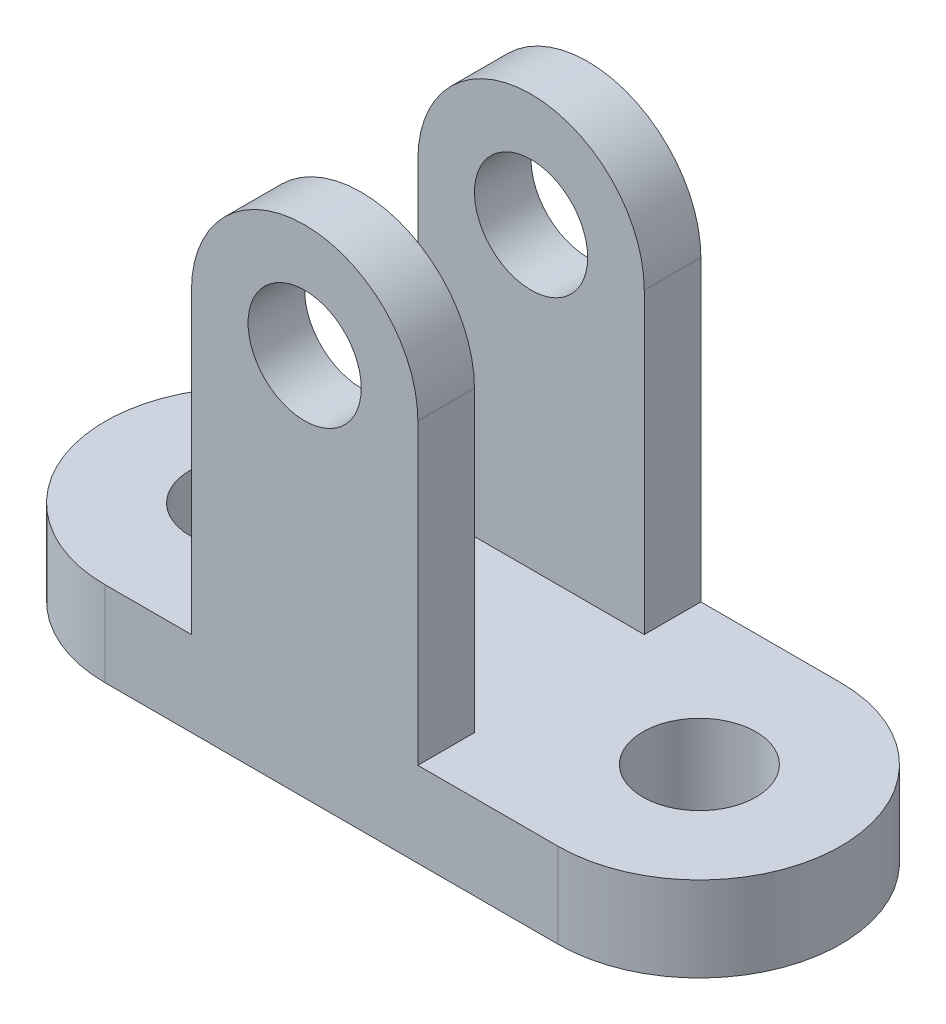
ISO-10303-21;
HEADER;
FILE_DESCRIPTION(('STEP AP214'),'2;1');
FILE_NAME('part.step','',(''),(''),'','','');
FILE_SCHEMA(('AUTOMOTIVE_DESIGN { 1 0 10303 214 1 1 1 1 }'));
ENDSEC;
DATA;
#1=APPLICATION_CONTEXT('core data for automotive mechanical design processes');
#2=APPLICATION_PROTOCOL_DEFINITION('international standard','automotive_design',2000,#1);
#3=PRODUCT_CONTEXT('',#1,'mechanical');
#4=PRODUCT('Part','Part','',(#3));
#5=PRODUCT_RELATED_PRODUCT_CATEGORY('part','',(#4));
#6=PRODUCT_DEFINITION_FORMATION('','',#4);
#7=PRODUCT_DEFINITION_CONTEXT('part definition',#1,'design');
#8=PRODUCT_DEFINITION('design','',#6,#7);
#9=PRODUCT_DEFINITION_SHAPE('','',#8);
#10=(LENGTH_UNIT() NAMED_UNIT(*) SI_UNIT(.MILLI.,.METRE.));
#11=(NAMED_UNIT(*) PLANE_ANGLE_UNIT() SI_UNIT($,.RADIAN.));
#12=(NAMED_UNIT(*) SI_UNIT($,.STERADIAN.) SOLID_ANGLE_UNIT());
#13=UNCERTAINTY_MEASURE_WITH_UNIT(LENGTH_MEASURE(1.E-05),#10,'distance_accuracy_value','');
#14=(GEOMETRIC_REPRESENTATION_CONTEXT(3) GLOBAL_UNCERTAINTY_ASSIGNED_CONTEXT((#13)) GLOBAL_UNIT_ASSIGNED_CONTEXT((#10,
#11,#12)) REPRESENTATION_CONTEXT('',''));
#15=CARTESIAN_POINT('',(0.,0.,0.));
#16=DIRECTION('',(0.,0.,1.));
#17=DIRECTION('',(1.,0.,0.));
#18=AXIS2_PLACEMENT_3D('',#15,#16,#17);
#19=CARTESIAN_POINT('',(0.,67.6994937518876,-25.));
#20=DIRECTION('',(0.,0.,1.));
#21=DIRECTION('',(1.,0.,0.));
#22=AXIS2_PLACEMENT_3D('',#19,#20,#21);
#23=CYLINDRICAL_SURFACE('',#22,20.);
#24=CARTESIAN_POINT('',(0.,67.6994937518876,15.));
#25=DIRECTION('',(0.,0.,1.));
#26=DIRECTION('',(0.,-1.,0.));
#27=AXIS2_PLACEMENT_3D('',#24,#25,#26);
#28=CIRCLE('',#27,20.);
#29=CARTESIAN_POINT('',(-20.,67.6994937518876,15.));
#30=VERTEX_POINT('',#29);
#31=CARTESIAN_POINT('',(20.,67.6994937518876,15.));
#32=VERTEX_POINT('',#31);
#33=EDGE_CURVE('E248',#30,#32,#28,.F.);
#34=ORIENTED_EDGE('',*,*,#33,.F.);
#35=DIRECTION('',(0.,0.,1.));
#36=VECTOR('',#35,1.);
#37=CARTESIAN_POINT('',(-20.,67.6994937518876,-25.));
#38=LINE('',#37,#36);
#39=CARTESIAN_POINT('',(-20.,67.6994937518876,25.));
#40=VERTEX_POINT('',#39);
#41=EDGE_CURVE('E179',#30,#40,#38,.T.);
#42=ORIENTED_EDGE('',*,*,#41,.T.);
#43=CARTESIAN_POINT('',(0.,67.6994937518876,25.));
#44=DIRECTION('',(0.,0.,1.));
#45=DIRECTION('',(1.,0.,0.));
#46=AXIS2_PLACEMENT_3D('',#43,#44,#45);
#47=CIRCLE('',#46,20.);
#48=CARTESIAN_POINT('',(20.,67.6994937518876,25.));
#49=VERTEX_POINT('',#48);
#50=EDGE_CURVE('E259',#49,#40,#47,.T.);
#51=ORIENTED_EDGE('',*,*,#50,.F.);
#52=DIRECTION('',(0.,0.,1.));
#53=VECTOR('',#52,1.);
#54=CARTESIAN_POINT('',(20.,67.6994937518876,-25.));
#55=LINE('',#54,#53);
#56=EDGE_CURVE('E164',#32,#49,#55,.T.);
#57=ORIENTED_EDGE('',*,*,#56,.F.);
#58=EDGE_LOOP('',(#34,#42,#51,#57));
#59=FACE_BOUND('',#58,.T.);
#60=ADVANCED_FACE('F45',(#59),#23,.T.);
#61=CARTESIAN_POINT('',(20.,67.6994937518876,-25.));
#62=DIRECTION('',(1.,0.,0.));
#63=DIRECTION('',(0.,0.,-1.));
#64=AXIS2_PLACEMENT_3D('',#61,#62,#63);
#65=PLANE('',#64);
#66=DIRECTION('',(0.,-1.,0.));
#67=VECTOR('',#66,1.);
#68=CARTESIAN_POINT('',(20.,67.6994937518876,15.));
#69=LINE('',#68,#67);
#70=CARTESIAN_POINT('',(20.,15.,15.));
#71=VERTEX_POINT('',#70);
#72=EDGE_CURVE('E251',#32,#71,#69,.T.);
#73=ORIENTED_EDGE('',*,*,#72,.F.);
#74=ORIENTED_EDGE('',*,*,#56,.T.);
#75=DIRECTION('',(0.,1.,0.));
#76=VECTOR('',#75,1.);
#77=CARTESIAN_POINT('',(20.,67.6994937518876,25.));
#78=LINE('',#77,#76);
#79=CARTESIAN_POINT('',(20.,15.,25.));
#80=VERTEX_POINT('',#79);
#81=EDGE_CURVE('E268',#80,#49,#78,.T.);
#82=ORIENTED_EDGE('',*,*,#81,.F.);
#83=DIRECTION('',(0.,0.,1.));
#84=VECTOR('',#83,1.);
#85=CARTESIAN_POINT('',(20.,15.,-25.));
#86=LINE('',#85,#84);
#87=EDGE_CURVE('E70',#71,#80,#86,.T.);
#88=ORIENTED_EDGE('',*,*,#87,.F.);
#89=EDGE_LOOP('',(#73,#74,#82,#88));
#90=FACE_BOUND('',#89,.T.);
#91=ADVANCED_FACE('F290',(#90),#65,.T.);
#92=CARTESIAN_POINT('',(-20.,67.6994937518876,-25.));
#93=DIRECTION('',(-1.,0.,0.));
#94=DIRECTION('',(0.,0.,1.));
#95=AXIS2_PLACEMENT_3D('',#92,#93,#94);
#96=PLANE('',#95);
#97=DIRECTION('',(0.,1.,0.));
#98=VECTOR('',#97,1.);
#99=CARTESIAN_POINT('',(-20.,67.6994937518876,15.));
#100=LINE('',#99,#98);
#101=CARTESIAN_POINT('',(-20.,15.,15.));
#102=VERTEX_POINT('',#101);
#103=EDGE_CURVE('E244',#102,#30,#100,.T.);
#104=ORIENTED_EDGE('',*,*,#103,.F.);
#105=DIRECTION('',(0.,0.,1.));
#106=VECTOR('',#105,1.);
#107=CARTESIAN_POINT('',(-20.,15.,-25.));
#108=LINE('',#107,#106);
#109=CARTESIAN_POINT('',(-20.,15.,25.));
#110=VERTEX_POINT('',#109);
#111=EDGE_CURVE('E174',#102,#110,#108,.T.);
#112=ORIENTED_EDGE('',*,*,#111,.T.);
#113=DIRECTION('',(0.,-1.,0.));
#114=VECTOR('',#113,1.);
#115=CARTESIAN_POINT('',(-20.,67.6994937518876,25.));
#116=LINE('',#115,#114);
#117=EDGE_CURVE('E277',#40,#110,#116,.T.);
#118=ORIENTED_EDGE('',*,*,#117,.F.);
#119=ORIENTED_EDGE('',*,*,#41,.F.);
#120=EDGE_LOOP('',(#104,#112,#118,#119));
#121=FACE_BOUND('',#120,.T.);
#122=ADVANCED_FACE('F298',(#121),#96,.T.);
#123=CARTESIAN_POINT('',(0.,67.6994937518876,-25.));
#124=DIRECTION('',(0.,0.,1.));
#125=DIRECTION('',(1.,0.,0.));
#126=AXIS2_PLACEMENT_3D('',#123,#124,#125);
#127=CYLINDRICAL_SURFACE('',#126,10.);
#128=CARTESIAN_POINT('',(0.,67.6994937518876,15.));
#129=DIRECTION('',(0.,0.,1.));
#130=DIRECTION('',(0.,-1.,0.));
#131=AXIS2_PLACEMENT_3D('',#128,#129,#130);
#132=CIRCLE('',#131,10.);
#133=CARTESIAN_POINT('',(0.,57.6994937518876,15.));
#134=VERTEX_POINT('',#133);
#135=EDGE_CURVE('E49',#134,#134,#132,.F.);
#136=ORIENTED_EDGE('',*,*,#135,.T.);
#137=EDGE_LOOP('',(#136));
#138=FACE_BOUND('',#137,.T.);
#139=CARTESIAN_POINT('',(0.,67.6994937518876,25.));
#140=DIRECTION('',(0.,0.,1.));
#141=DIRECTION('',(1.,0.,0.));
#142=AXIS2_PLACEMENT_3D('',#139,#140,#141);
#143=CIRCLE('',#142,10.);
#144=CARTESIAN_POINT('',(10.,67.6994937518876,25.));
#145=VERTEX_POINT('',#144);
#146=EDGE_CURVE('E254',#145,#145,#143,.T.);
#147=ORIENTED_EDGE('',*,*,#146,.T.);
#148=EDGE_LOOP('',(#147));
#149=FACE_BOUND('',#148,.T.);
#150=ADVANCED_FACE('F336',(#138,#149),#127,.F.);
#151=CARTESIAN_POINT('',(-35.2583588511625,15.,0.));
#152=DIRECTION('',(0.,1.,0.));
#153=DIRECTION('',(0.,0.,1.));
#154=AXIS2_PLACEMENT_3D('',#151,#152,#153);
#155=PLANE('',#154);
#156=CARTESIAN_POINT('',(20.,15.,-25.));
#157=VERTEX_POINT('',#156);
#158=CARTESIAN_POINT('',(20.,15.,-15.));
#159=VERTEX_POINT('',#158);
#160=EDGE_CURVE('E152',#157,#159,#86,.T.);
#161=ORIENTED_EDGE('',*,*,#160,.T.);
#162=DIRECTION('',(1.,0.,0.));
#163=VECTOR('',#162,1.);
#164=CARTESIAN_POINT('',(-25.,15.,-15.));
#165=LINE('',#164,#163);
#166=CARTESIAN_POINT('',(-20.,15.,-15.));
#167=VERTEX_POINT('',#166);
#168=EDGE_CURVE('E63',#167,#159,#165,.T.);
#169=ORIENTED_EDGE('',*,*,#168,.F.);
#170=CARTESIAN_POINT('',(-20.,15.,-25.));
#171=VERTEX_POINT('',#170);
#172=EDGE_CURVE('E169',#171,#167,#108,.T.);
#173=ORIENTED_EDGE('',*,*,#172,.F.);
#174=DIRECTION('',(-1.,0.,0.));
#175=VECTOR('',#174,1.);
#176=CARTESIAN_POINT('',(-35.2583588511625,15.,-25.));
#177=LINE('',#176,#175);
#178=CARTESIAN_POINT('',(-35.2583588511625,15.,-25.));
#179=VERTEX_POINT('',#178);
#180=EDGE_CURVE('E210',#171,#179,#177,.T.);
#181=ORIENTED_EDGE('',*,*,#180,.T.);
#182=CARTESIAN_POINT('',(-35.2583588511625,15.,0.));
#183=DIRECTION('',(0.,1.,0.));
#184=DIRECTION('',(0.,0.,1.));
#185=AXIS2_PLACEMENT_3D('',#182,#183,#184);
#186=CIRCLE('',#185,25.);
#187=CARTESIAN_POINT('',(-35.2583588511625,15.,25.));
#188=VERTEX_POINT('',#187);
#189=EDGE_CURVE('E197',#179,#188,#186,.T.);
#190=ORIENTED_EDGE('',*,*,#189,.T.);
#191=DIRECTION('',(1.,0.,0.));
#192=VECTOR('',#191,1.);
#193=CARTESIAN_POINT('',(-35.2583588511625,15.,25.));
#194=LINE('',#193,#192);
#195=EDGE_CURVE('E203',#188,#110,#194,.T.);
#196=ORIENTED_EDGE('',*,*,#195,.T.);
#197=ORIENTED_EDGE('',*,*,#111,.F.);
#198=DIRECTION('',(1.,0.,0.));
#199=VECTOR('',#198,1.);
#200=CARTESIAN_POINT('',(-25.,15.,15.));
#201=LINE('',#200,#199);
#202=EDGE_CURVE('E146',#102,#71,#201,.T.);
#203=ORIENTED_EDGE('',*,*,#202,.T.);
#204=ORIENTED_EDGE('',*,*,#87,.T.);
#205=CARTESIAN_POINT('',(44.7416411488375,15.,25.));
#206=VERTEX_POINT('',#205);
#207=EDGE_CURVE('E201',#80,#206,#194,.T.);
#208=ORIENTED_EDGE('',*,*,#207,.T.);
#209=CARTESIAN_POINT('',(44.7416411488375,15.,0.));
#210=DIRECTION('',(0.,1.,0.));
#211=DIRECTION('',(0.,0.,1.));
#212=AXIS2_PLACEMENT_3D('',#209,#210,#211);
#213=CIRCLE('',#212,25.);
#214=CARTESIAN_POINT('',(44.7416411488375,15.,-25.));
#215=VERTEX_POINT('',#214);
#216=EDGE_CURVE('E207',#206,#215,#213,.T.);
#217=ORIENTED_EDGE('',*,*,#216,.T.);
#218=EDGE_CURVE('E162',#215,#157,#177,.T.);
#219=ORIENTED_EDGE('',*,*,#218,.T.);
#220=EDGE_LOOP('',(#161,#169,#173,#181,#190,#196,#197,#203,#204,#208,#217,#219));
#221=FACE_BOUND('',#220,.T.);
#222=CARTESIAN_POINT('',(-35.2583588511625,15.,0.));
#223=DIRECTION('',(0.,1.,0.));
#224=DIRECTION('',(0.,0.,1.));
#225=AXIS2_PLACEMENT_3D('',#222,#223,#224);
#226=CIRCLE('',#225,10.);
#227=CARTESIAN_POINT('',(-35.2583588511625,15.,10.));
#228=VERTEX_POINT('',#227);
#229=EDGE_CURVE('E189',#228,#228,#226,.T.);
#230=ORIENTED_EDGE('',*,*,#229,.F.);
#231=EDGE_LOOP('',(#230));
#232=FACE_BOUND('',#231,.T.);
#233=CARTESIAN_POINT('',(44.7416411488375,15.,0.));
#234=DIRECTION('',(0.,1.,0.));
#235=DIRECTION('',(0.,0.,1.));
#236=AXIS2_PLACEMENT_3D('',#233,#234,#235);
#237=CIRCLE('',#236,10.);
#238=CARTESIAN_POINT('',(44.7416411488375,15.,10.));
#239=VERTEX_POINT('',#238);
#240=EDGE_CURVE('E180',#239,#239,#237,.T.);
#241=ORIENTED_EDGE('',*,*,#240,.F.);
#242=EDGE_LOOP('',(#241));
#243=FACE_BOUND('',#242,.T.);
#244=ADVANCED_FACE('F159',(#221,#232,#243),#155,.T.);
#245=CARTESIAN_POINT('',(-35.2583588511625,0.,0.));
#246=DIRECTION('',(0.,1.,0.));
#247=DIRECTION('',(0.,0.,1.));
#248=AXIS2_PLACEMENT_3D('',#245,#246,#247);
#249=PLANE('',#248);
#250=CARTESIAN_POINT('',(-35.2583588511625,0.,0.));
#251=DIRECTION('',(0.,1.,0.));
#252=DIRECTION('',(0.,0.,1.));
#253=AXIS2_PLACEMENT_3D('',#250,#251,#252);
#254=CIRCLE('',#253,25.);
#255=CARTESIAN_POINT('',(-35.2583588511625,0.,-25.));
#256=VERTEX_POINT('',#255);
#257=CARTESIAN_POINT('',(-35.2583588511625,0.,25.));
#258=VERTEX_POINT('',#257);
#259=EDGE_CURVE('E193',#256,#258,#254,.T.);
#260=ORIENTED_EDGE('',*,*,#259,.F.);
#261=DIRECTION('',(-1.,0.,0.));
#262=VECTOR('',#261,1.);
#263=CARTESIAN_POINT('',(-35.2583588511625,0.,-25.));
#264=LINE('',#263,#262);
#265=CARTESIAN_POINT('',(44.7416411488375,0.,-25.));
#266=VERTEX_POINT('',#265);
#267=EDGE_CURVE('E202',#266,#256,#264,.T.);
#268=ORIENTED_EDGE('',*,*,#267,.F.);
#269=CARTESIAN_POINT('',(44.7416411488375,0.,0.));
#270=DIRECTION('',(0.,1.,0.));
#271=DIRECTION('',(0.,0.,1.));
#272=AXIS2_PLACEMENT_3D('',#269,#270,#271);
#273=CIRCLE('',#272,25.);
#274=CARTESIAN_POINT('',(44.7416411488375,0.,25.));
#275=VERTEX_POINT('',#274);
#276=EDGE_CURVE('E220',#275,#266,#273,.T.);
#277=ORIENTED_EDGE('',*,*,#276,.F.);
#278=DIRECTION('',(1.,0.,0.));
#279=VECTOR('',#278,1.);
#280=CARTESIAN_POINT('',(-35.2583588511625,0.,25.));
#281=LINE('',#280,#279);
#282=EDGE_CURVE('E217',#258,#275,#281,.T.);
#283=ORIENTED_EDGE('',*,*,#282,.F.);
#284=EDGE_LOOP('',(#260,#268,#277,#283));
#285=FACE_BOUND('',#284,.T.);
#286=CARTESIAN_POINT('',(-35.2583588511625,0.,0.));
#287=DIRECTION('',(0.,1.,0.));
#288=DIRECTION('',(0.,0.,1.));
#289=AXIS2_PLACEMENT_3D('',#286,#287,#288);
#290=CIRCLE('',#289,10.);
#291=CARTESIAN_POINT('',(-35.2583588511625,0.,10.));
#292=VERTEX_POINT('',#291);
#293=EDGE_CURVE('E184',#292,#292,#290,.T.);
#294=ORIENTED_EDGE('',*,*,#293,.T.);
#295=EDGE_LOOP('',(#294));
#296=FACE_BOUND('',#295,.T.);
#297=CARTESIAN_POINT('',(44.7416411488375,0.,0.));
#298=DIRECTION('',(0.,1.,0.));
#299=DIRECTION('',(0.,0.,1.));
#300=AXIS2_PLACEMENT_3D('',#297,#298,#299);
#301=CIRCLE('',#300,10.);
#302=CARTESIAN_POINT('',(44.7416411488375,0.,10.));
#303=VERTEX_POINT('',#302);
#304=EDGE_CURVE('E185',#303,#303,#301,.T.);
#305=ORIENTED_EDGE('',*,*,#304,.T.);
#306=EDGE_LOOP('',(#305));
#307=FACE_BOUND('',#306,.T.);
#308=ADVANCED_FACE('F313',(#285,#296,#307),#249,.F.);
#309=CARTESIAN_POINT('',(-35.2583588511625,15.,0.));
#310=DIRECTION('',(0.,-1.,0.));
#311=DIRECTION('',(0.,0.,-1.));
#312=AXIS2_PLACEMENT_3D('',#309,#310,#311);
#313=CYLINDRICAL_SURFACE('',#312,25.);
#314=ORIENTED_EDGE('',*,*,#259,.T.);
#315=DIRECTION('',(0.,-1.,0.));
#316=VECTOR('',#315,1.);
#317=CARTESIAN_POINT('',(-35.2583588511625,15.,25.));
#318=LINE('',#317,#316);
#319=EDGE_CURVE('E11',#188,#258,#318,.T.);
#320=ORIENTED_EDGE('',*,*,#319,.F.);
#321=ORIENTED_EDGE('',*,*,#189,.F.);
#322=DIRECTION('',(0.,-1.,0.));
#323=VECTOR('',#322,1.);
#324=CARTESIAN_POINT('',(-35.2583588511625,15.,-25.));
#325=LINE('',#324,#323);
#326=EDGE_CURVE('E213',#179,#256,#325,.T.);
#327=ORIENTED_EDGE('',*,*,#326,.T.);
#328=EDGE_LOOP('',(#314,#320,#321,#327));
#329=FACE_BOUND('',#328,.T.);
#330=ADVANCED_FACE('F47',(#329),#313,.T.);
#331=CARTESIAN_POINT('',(-35.2583588511625,15.,25.));
#332=DIRECTION('',(0.,0.,-1.));
#333=DIRECTION('',(-1.,0.,0.));
#334=AXIS2_PLACEMENT_3D('',#331,#332,#333);
#335=PLANE('',#334);
#336=ORIENTED_EDGE('',*,*,#282,.T.);
#337=DIRECTION('',(0.,-1.,0.));
#338=VECTOR('',#337,1.);
#339=CARTESIAN_POINT('',(44.7416411488375,15.,25.));
#340=LINE('',#339,#338);
#341=EDGE_CURVE('E55',#206,#275,#340,.T.);
#342=ORIENTED_EDGE('',*,*,#341,.F.);
#343=ORIENTED_EDGE('',*,*,#207,.F.);
#344=ORIENTED_EDGE('',*,*,#81,.T.);
#345=ORIENTED_EDGE('',*,*,#50,.T.);
#346=ORIENTED_EDGE('',*,*,#117,.T.);
#347=ORIENTED_EDGE('',*,*,#195,.F.);
#348=ORIENTED_EDGE('',*,*,#319,.T.);
#349=EDGE_LOOP('',(#336,#342,#343,#344,#345,#346,#347,#348));
#350=FACE_BOUND('',#349,.T.);
#351=ORIENTED_EDGE('',*,*,#146,.F.);
#352=EDGE_LOOP('',(#351));
#353=FACE_BOUND('',#352,.T.);
#354=ADVANCED_FACE('F284',(#350,#353),#335,.F.);
#355=CARTESIAN_POINT('',(44.7416411488375,15.,0.));
#356=DIRECTION('',(0.,-1.,0.));
#357=DIRECTION('',(0.,0.,-1.));
#358=AXIS2_PLACEMENT_3D('',#355,#356,#357);
#359=CYLINDRICAL_SURFACE('',#358,25.);
#360=ORIENTED_EDGE('',*,*,#276,.T.);
#361=DIRECTION('',(0.,-1.,0.));
#362=VECTOR('',#361,1.);
#363=CARTESIAN_POINT('',(44.7416411488375,15.,-25.));
#364=LINE('',#363,#362);
#365=EDGE_CURVE('E228',#215,#266,#364,.T.);
#366=ORIENTED_EDGE('',*,*,#365,.F.);
#367=ORIENTED_EDGE('',*,*,#216,.F.);
#368=ORIENTED_EDGE('',*,*,#341,.T.);
#369=EDGE_LOOP('',(#360,#366,#367,#368));
#370=FACE_BOUND('',#369,.T.);
#371=ADVANCED_FACE('F310',(#370),#359,.T.);
#372=CARTESIAN_POINT('',(-35.2583588511625,15.,-25.));
#373=DIRECTION('',(0.,0.,1.));
#374=DIRECTION('',(1.,0.,0.));
#375=AXIS2_PLACEMENT_3D('',#372,#373,#374);
#376=PLANE('',#375);
#377=ORIENTED_EDGE('',*,*,#267,.T.);
#378=ORIENTED_EDGE('',*,*,#326,.F.);
#379=ORIENTED_EDGE('',*,*,#180,.F.);
#380=DIRECTION('',(0.,-1.,0.));
#381=VECTOR('',#380,1.);
#382=CARTESIAN_POINT('',(-20.,67.6994937518876,-25.));
#383=LINE('',#382,#381);
#384=CARTESIAN_POINT('',(-20.,67.6994937518876,-25.));
#385=VERTEX_POINT('',#384);
#386=EDGE_CURVE('E267',#385,#171,#383,.T.);
#387=ORIENTED_EDGE('',*,*,#386,.F.);
#388=CARTESIAN_POINT('',(0.,67.6994937518876,-25.));
#389=DIRECTION('',(0.,0.,1.));
#390=DIRECTION('',(1.,0.,0.));
#391=AXIS2_PLACEMENT_3D('',#388,#389,#390);
#392=CIRCLE('',#391,20.);
#393=CARTESIAN_POINT('',(20.,67.6994937518876,-25.));
#394=VERTEX_POINT('',#393);
#395=EDGE_CURVE('E263',#394,#385,#392,.T.);
#396=ORIENTED_EDGE('',*,*,#395,.F.);
#397=DIRECTION('',(0.,1.,0.));
#398=VECTOR('',#397,1.);
#399=CARTESIAN_POINT('',(20.,67.6994937518876,-25.));
#400=LINE('',#399,#398);
#401=EDGE_CURVE('E271',#157,#394,#400,.T.);
#402=ORIENTED_EDGE('',*,*,#401,.F.);
#403=ORIENTED_EDGE('',*,*,#218,.F.);
#404=ORIENTED_EDGE('',*,*,#365,.T.);
#405=EDGE_LOOP('',(#377,#378,#379,#387,#396,#402,#403,#404));
#406=FACE_BOUND('',#405,.T.);
#407=CARTESIAN_POINT('',(0.,67.6994937518876,-25.));
#408=DIRECTION('',(0.,0.,1.));
#409=DIRECTION('',(1.,0.,0.));
#410=AXIS2_PLACEMENT_3D('',#407,#408,#409);
#411=CIRCLE('',#410,10.);
#412=CARTESIAN_POINT('',(10.,67.6994937518876,-25.));
#413=VERTEX_POINT('',#412);
#414=EDGE_CURVE('E255',#413,#413,#411,.T.);
#415=ORIENTED_EDGE('',*,*,#414,.T.);
#416=EDGE_LOOP('',(#415));
#417=FACE_BOUND('',#416,.T.);
#418=ADVANCED_FACE('F316',(#406,#417),#376,.F.);
#419=CARTESIAN_POINT('',(-35.2583588511625,15.,0.));
#420=DIRECTION('',(0.,-1.,0.));
#421=DIRECTION('',(0.,0.,-1.));
#422=AXIS2_PLACEMENT_3D('',#419,#420,#421);
#423=CYLINDRICAL_SURFACE('',#422,10.);
#424=ORIENTED_EDGE('',*,*,#229,.T.);
#425=EDGE_LOOP('',(#424));
#426=FACE_BOUND('',#425,.T.);
#427=ORIENTED_EDGE('',*,*,#293,.F.);
#428=EDGE_LOOP('',(#427));
#429=FACE_BOUND('',#428,.T.);
#430=ADVANCED_FACE('F352',(#426,#429),#423,.F.);
#431=CARTESIAN_POINT('',(44.7416411488375,15.,0.));
#432=DIRECTION('',(0.,-1.,0.));
#433=DIRECTION('',(0.,0.,-1.));
#434=AXIS2_PLACEMENT_3D('',#431,#432,#433);
#435=CYLINDRICAL_SURFACE('',#434,10.);
#436=ORIENTED_EDGE('',*,*,#240,.T.);
#437=EDGE_LOOP('',(#436));
#438=FACE_BOUND('',#437,.T.);
#439=ORIENTED_EDGE('',*,*,#304,.F.);
#440=EDGE_LOOP('',(#439));
#441=FACE_BOUND('',#440,.T.);
#442=ADVANCED_FACE('F347',(#438,#441),#435,.F.);
#443=CARTESIAN_POINT('',(-20.,67.6994937518876,-15.));
#444=VERTEX_POINT('',#443);
#445=EDGE_CURVE('E175',#385,#444,#38,.T.);
#446=ORIENTED_EDGE('',*,*,#445,.T.);
#447=CARTESIAN_POINT('',(0.,67.6994937518876,-15.));
#448=DIRECTION('',(0.,0.,-1.));
#449=DIRECTION('',(0.,1.,0.));
#450=AXIS2_PLACEMENT_3D('',#447,#448,#449);
#451=CIRCLE('',#450,20.);
#452=CARTESIAN_POINT('',(20.,67.6994937518876,-15.));
#453=VERTEX_POINT('',#452);
#454=EDGE_CURVE('E156',#453,#444,#451,.F.);
#455=ORIENTED_EDGE('',*,*,#454,.F.);
#456=EDGE_CURVE('E154',#394,#453,#55,.T.);
#457=ORIENTED_EDGE('',*,*,#456,.F.);
#458=ORIENTED_EDGE('',*,*,#395,.T.);
#459=EDGE_LOOP('',(#446,#455,#457,#458));
#460=FACE_BOUND('',#459,.T.);
#461=ADVANCED_FACE('F321',(#460),#23,.T.);
#462=DIRECTION('',(0.,1.,0.));
#463=VECTOR('',#462,1.);
#464=CARTESIAN_POINT('',(20.,67.6994937518876,-15.));
#465=LINE('',#464,#463);
#466=EDGE_CURVE('E139',#159,#453,#465,.T.);
#467=ORIENTED_EDGE('',*,*,#466,.F.);
#468=ORIENTED_EDGE('',*,*,#160,.F.);
#469=ORIENTED_EDGE('',*,*,#401,.T.);
#470=ORIENTED_EDGE('',*,*,#456,.T.);
#471=EDGE_LOOP('',(#467,#468,#469,#470));
#472=FACE_BOUND('',#471,.T.);
#473=ADVANCED_FACE('F150',(#472),#65,.T.);
#474=DIRECTION('',(0.,-1.,0.));
#475=VECTOR('',#474,1.);
#476=CARTESIAN_POINT('',(-20.,67.6994937518876,-15.));
#477=LINE('',#476,#475);
#478=EDGE_CURVE('E142',#444,#167,#477,.T.);
#479=ORIENTED_EDGE('',*,*,#478,.F.);
#480=ORIENTED_EDGE('',*,*,#445,.F.);
#481=ORIENTED_EDGE('',*,*,#386,.T.);
#482=ORIENTED_EDGE('',*,*,#172,.T.);
#483=EDGE_LOOP('',(#479,#480,#481,#482));
#484=FACE_BOUND('',#483,.T.);
#485=ADVANCED_FACE('F326',(#484),#96,.T.);
#486=CARTESIAN_POINT('',(0.,67.6994937518876,-15.));
#487=DIRECTION('',(0.,0.,-1.));
#488=DIRECTION('',(0.,1.,0.));
#489=AXIS2_PLACEMENT_3D('',#486,#487,#488);
#490=CIRCLE('',#489,10.);
#491=CARTESIAN_POINT('',(0.,77.6994937518876,-15.));
#492=VERTEX_POINT('',#491);
#493=EDGE_CURVE('E145',#492,#492,#490,.F.);
#494=ORIENTED_EDGE('',*,*,#493,.T.);
#495=EDGE_LOOP('',(#494));
#496=FACE_BOUND('',#495,.T.);
#497=ORIENTED_EDGE('',*,*,#414,.F.);
#498=EDGE_LOOP('',(#497));
#499=FACE_BOUND('',#498,.T.);
#500=ADVANCED_FACE('F328',(#496,#499),#127,.F.);
#501=CARTESIAN_POINT('',(-25.,87.6994937518876,15.));
#502=DIRECTION('',(0.,0.,1.));
#503=DIRECTION('',(0.,-1.,0.));
#504=AXIS2_PLACEMENT_3D('',#501,#502,#503);
#505=PLANE('',#504);
#506=ORIENTED_EDGE('',*,*,#72,.T.);
#507=ORIENTED_EDGE('',*,*,#202,.F.);
#508=ORIENTED_EDGE('',*,*,#103,.T.);
#509=ORIENTED_EDGE('',*,*,#33,.T.);
#510=EDGE_LOOP('',(#506,#507,#508,#509));
#511=FACE_BOUND('',#510,.T.);
#512=ORIENTED_EDGE('',*,*,#135,.F.);
#513=EDGE_LOOP('',(#512));
#514=FACE_BOUND('',#513,.T.);
#515=ADVANCED_FACE('F334',(#511,#514),#505,.F.);
#516=CARTESIAN_POINT('',(-25.,87.6994937518876,-15.));
#517=DIRECTION('',(0.,0.,-1.));
#518=DIRECTION('',(0.,1.,0.));
#519=AXIS2_PLACEMENT_3D('',#516,#517,#518);
#520=PLANE('',#519);
#521=ORIENTED_EDGE('',*,*,#466,.T.);
#522=ORIENTED_EDGE('',*,*,#454,.T.);
#523=ORIENTED_EDGE('',*,*,#478,.T.);
#524=ORIENTED_EDGE('',*,*,#168,.T.);
#525=EDGE_LOOP('',(#521,#522,#523,#524));
#526=FACE_BOUND('',#525,.T.);
#527=ORIENTED_EDGE('',*,*,#493,.F.);
#528=EDGE_LOOP('',(#527));
#529=FACE_BOUND('',#528,.T.);
#530=ADVANCED_FACE('F137',(#526,#529),#520,.F.);
#531=CLOSED_SHELL('',(#60,#91,#122,#150,#244,#308,#330,#354,#371,#418,#430,#442,#461,#473,#485,
#500,#515,#530));
#532=MANIFOLD_SOLID_BREP('B2',#531);
#533=ADVANCED_BREP_SHAPE_REPRESENTATION('',(#18,#532),#14);
#534=SHAPE_DEFINITION_REPRESENTATION(#9,#533);
ENDSEC;
END-ISO-10303-21;
